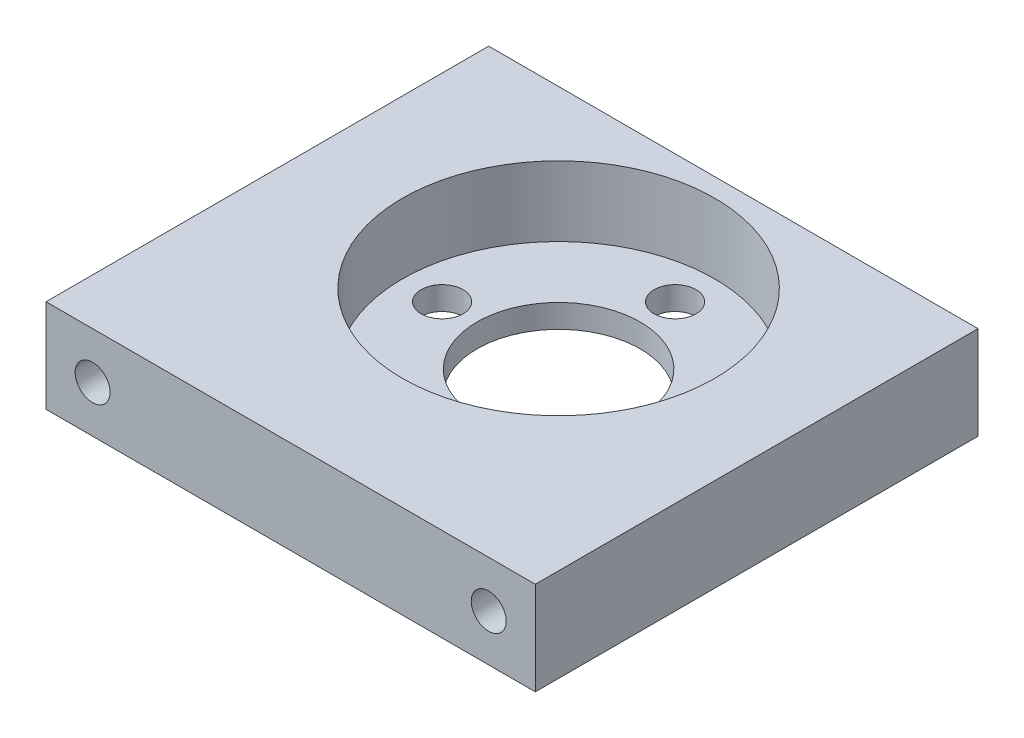
ISO-10303-21;
HEADER;
FILE_DESCRIPTION(('STEP AP214'),'2;1');
FILE_NAME('part.step','',(''),(''),'','','');
FILE_SCHEMA(('AUTOMOTIVE_DESIGN { 1 0 10303 214 1 1 1 1 }'));
ENDSEC;
DATA;
#1=APPLICATION_CONTEXT('core data for automotive mechanical design processes');
#2=APPLICATION_PROTOCOL_DEFINITION('international standard','automotive_design',2000,#1);
#3=PRODUCT_CONTEXT('',#1,'mechanical');
#4=PRODUCT('Part','Part','',(#3));
#5=PRODUCT_RELATED_PRODUCT_CATEGORY('part','',(#4));
#6=PRODUCT_DEFINITION_FORMATION('','',#4);
#7=PRODUCT_DEFINITION_CONTEXT('part definition',#1,'design');
#8=PRODUCT_DEFINITION('design','',#6,#7);
#9=PRODUCT_DEFINITION_SHAPE('','',#8);
#10=(LENGTH_UNIT() NAMED_UNIT(*) SI_UNIT(.MILLI.,.METRE.));
#11=(NAMED_UNIT(*) PLANE_ANGLE_UNIT() SI_UNIT($,.RADIAN.));
#12=(NAMED_UNIT(*) SI_UNIT($,.STERADIAN.) SOLID_ANGLE_UNIT());
#13=UNCERTAINTY_MEASURE_WITH_UNIT(LENGTH_MEASURE(1.E-05),#10,'distance_accuracy_value','');
#14=(GEOMETRIC_REPRESENTATION_CONTEXT(3) GLOBAL_UNCERTAINTY_ASSIGNED_CONTEXT((#13)) GLOBAL_UNIT_ASSIGNED_CONTEXT((#10,
#11,#12)) REPRESENTATION_CONTEXT('',''));
#15=CARTESIAN_POINT('',(0.,0.,0.));
#16=DIRECTION('',(0.,0.,1.));
#17=DIRECTION('',(1.,0.,0.));
#18=AXIS2_PLACEMENT_3D('',#15,#16,#17);
#19=CARTESIAN_POINT('',(0.,8.,0.));
#20=DIRECTION('',(1.,0.,0.));
#21=DIRECTION('',(0.,0.,-1.));
#22=AXIS2_PLACEMENT_3D('',#19,#20,#21);
#23=PLANE('',#22);
#24=DIRECTION('',(0.,0.,1.));
#25=VECTOR('',#24,1.);
#26=CARTESIAN_POINT('',(0.,8.,0.));
#27=LINE('',#26,#25);
#28=CARTESIAN_POINT('',(0.,8.,-38.));
#29=VERTEX_POINT('',#28);
#30=CARTESIAN_POINT('',(0.,8.,0.));
#31=VERTEX_POINT('',#30);
#32=EDGE_CURVE('E94',#29,#31,#27,.T.);
#33=ORIENTED_EDGE('',*,*,#32,.F.);
#34=DIRECTION('',(0.,1.,0.));
#35=VECTOR('',#34,1.);
#36=CARTESIAN_POINT('',(0.,-0.000999999999999265,-38.));
#37=LINE('',#36,#35);
#38=CARTESIAN_POINT('',(0.,0.,-38.));
#39=VERTEX_POINT('',#38);
#40=EDGE_CURVE('E150',#39,#29,#37,.T.);
#41=ORIENTED_EDGE('',*,*,#40,.F.);
#42=DIRECTION('',(0.,0.,1.));
#43=VECTOR('',#42,1.);
#44=CARTESIAN_POINT('',(0.,0.,0.));
#45=LINE('',#44,#43);
#46=CARTESIAN_POINT('',(0.,0.,0.));
#47=VERTEX_POINT('',#46);
#48=EDGE_CURVE('E85',#39,#47,#45,.T.);
#49=ORIENTED_EDGE('',*,*,#48,.T.);
#50=DIRECTION('',(0.,-1.,0.));
#51=VECTOR('',#50,1.);
#52=CARTESIAN_POINT('',(0.,8.,0.));
#53=LINE('',#52,#51);
#54=EDGE_CURVE('E11',#31,#47,#53,.T.);
#55=ORIENTED_EDGE('',*,*,#54,.F.);
#56=EDGE_LOOP('',(#33,#41,#49,#55));
#57=FACE_BOUND('',#56,.T.);
#58=ADVANCED_FACE('F41',(#57),#23,.F.);
#59=CARTESIAN_POINT('',(0.,8.,0.));
#60=DIRECTION('',(0.,0.,-1.));
#61=DIRECTION('',(-1.,0.,0.));
#62=AXIS2_PLACEMENT_3D('',#59,#60,#61);
#63=PLANE('',#62);
#64=CARTESIAN_POINT('',(38.,4.,0.));
#65=DIRECTION('',(0.,0.,-1.));
#66=DIRECTION('',(-1.,0.,0.));
#67=AXIS2_PLACEMENT_3D('',#64,#65,#66);
#68=CIRCLE('',#67,1.5);
#69=CARTESIAN_POINT('',(36.5,4.,0.));
#70=VERTEX_POINT('',#69);
#71=EDGE_CURVE('E130',#70,#70,#68,.T.);
#72=ORIENTED_EDGE('',*,*,#71,.T.);
#73=EDGE_LOOP('',(#72));
#74=FACE_BOUND('',#73,.T.);
#75=CARTESIAN_POINT('',(4.,4.,0.));
#76=DIRECTION('',(0.,0.,-1.));
#77=DIRECTION('',(-1.,0.,0.));
#78=AXIS2_PLACEMENT_3D('',#75,#76,#77);
#79=CIRCLE('',#78,1.5);
#80=CARTESIAN_POINT('',(2.5,4.,0.));
#81=VERTEX_POINT('',#80);
#82=EDGE_CURVE('E138',#81,#81,#79,.T.);
#83=ORIENTED_EDGE('',*,*,#82,.T.);
#84=EDGE_LOOP('',(#83));
#85=FACE_BOUND('',#84,.T.);
#86=DIRECTION('',(1.,0.,0.));
#87=VECTOR('',#86,1.);
#88=CARTESIAN_POINT('',(0.,0.,0.));
#89=LINE('',#88,#87);
#90=CARTESIAN_POINT('',(42.,0.,0.));
#91=VERTEX_POINT('',#90);
#92=EDGE_CURVE('E76',#47,#91,#89,.T.);
#93=ORIENTED_EDGE('',*,*,#92,.T.);
#94=DIRECTION('',(0.,-1.,0.));
#95=VECTOR('',#94,1.);
#96=CARTESIAN_POINT('',(42.,8.,0.));
#97=LINE('',#96,#95);
#98=CARTESIAN_POINT('',(42.,8.,0.));
#99=VERTEX_POINT('',#98);
#100=EDGE_CURVE('E48',#99,#91,#97,.T.);
#101=ORIENTED_EDGE('',*,*,#100,.F.);
#102=DIRECTION('',(1.,0.,0.));
#103=VECTOR('',#102,1.);
#104=CARTESIAN_POINT('',(0.,8.,0.));
#105=LINE('',#104,#103);
#106=EDGE_CURVE('E64',#31,#99,#105,.T.);
#107=ORIENTED_EDGE('',*,*,#106,.F.);
#108=ORIENTED_EDGE('',*,*,#54,.T.);
#109=EDGE_LOOP('',(#93,#101,#107,#108));
#110=FACE_BOUND('',#109,.T.);
#111=ADVANCED_FACE('F78',(#74,#85,#110),#63,.F.);
#112=CARTESIAN_POINT('',(42.,8.,0.));
#113=DIRECTION('',(-1.,0.,0.));
#114=DIRECTION('',(0.,0.,1.));
#115=AXIS2_PLACEMENT_3D('',#112,#113,#114);
#116=PLANE('',#115);
#117=DIRECTION('',(0.,0.,-1.));
#118=VECTOR('',#117,1.);
#119=CARTESIAN_POINT('',(42.,0.,0.));
#120=LINE('',#119,#118);
#121=CARTESIAN_POINT('',(42.,0.,-38.));
#122=VERTEX_POINT('',#121);
#123=EDGE_CURVE('E84',#91,#122,#120,.T.);
#124=ORIENTED_EDGE('',*,*,#123,.T.);
#125=DIRECTION('',(0.,1.,0.));
#126=VECTOR('',#125,1.);
#127=CARTESIAN_POINT('',(42.,-0.000999999999999265,-38.));
#128=LINE('',#127,#126);
#129=CARTESIAN_POINT('',(42.,8.,-38.));
#130=VERTEX_POINT('',#129);
#131=EDGE_CURVE('E55',#122,#130,#128,.T.);
#132=ORIENTED_EDGE('',*,*,#131,.T.);
#133=DIRECTION('',(0.,0.,-1.));
#134=VECTOR('',#133,1.);
#135=CARTESIAN_POINT('',(42.,8.,0.));
#136=LINE('',#135,#134);
#137=EDGE_CURVE('E90',#99,#130,#136,.T.);
#138=ORIENTED_EDGE('',*,*,#137,.F.);
#139=ORIENTED_EDGE('',*,*,#100,.T.);
#140=EDGE_LOOP('',(#124,#132,#138,#139));
#141=FACE_BOUND('',#140,.T.);
#142=ADVANCED_FACE('F89',(#141),#116,.F.);
#143=CARTESIAN_POINT('',(0.,8.,0.));
#144=DIRECTION('',(0.,-1.,0.));
#145=DIRECTION('',(0.,0.,-1.));
#146=AXIS2_PLACEMENT_3D('',#143,#144,#145);
#147=PLANE('',#146);
#148=CARTESIAN_POINT('',(21.,8.,-23.));
#149=DIRECTION('',(0.,1.,0.));
#150=DIRECTION('',(0.,0.,1.));
#151=AXIS2_PLACEMENT_3D('',#148,#149,#150);
#152=CIRCLE('',#151,13.4);
#153=CARTESIAN_POINT('',(21.,8.,-9.60000000000003));
#154=VERTEX_POINT('',#153);
#155=EDGE_CURVE('E102',#154,#154,#152,.T.);
#156=ORIENTED_EDGE('',*,*,#155,.F.);
#157=EDGE_LOOP('',(#156));
#158=FACE_BOUND('',#157,.T.);
#159=ORIENTED_EDGE('',*,*,#137,.T.);
#160=DIRECTION('',(1.,0.,0.));
#161=VECTOR('',#160,1.);
#162=CARTESIAN_POINT('',(0.,8.,-38.));
#163=LINE('',#162,#161);
#164=EDGE_CURVE('E153',#29,#130,#163,.T.);
#165=ORIENTED_EDGE('',*,*,#164,.F.);
#166=ORIENTED_EDGE('',*,*,#32,.T.);
#167=ORIENTED_EDGE('',*,*,#106,.T.);
#168=EDGE_LOOP('',(#159,#165,#166,#167));
#169=FACE_BOUND('',#168,.T.);
#170=ADVANCED_FACE('F160',(#158,#169),#147,.F.);
#171=CARTESIAN_POINT('',(0.,0.,0.));
#172=DIRECTION('',(0.,-1.,0.));
#173=DIRECTION('',(0.,0.,-1.));
#174=AXIS2_PLACEMENT_3D('',#171,#172,#173);
#175=PLANE('',#174);
#176=DIRECTION('',(1.,0.,0.));
#177=VECTOR('',#176,1.);
#178=CARTESIAN_POINT('',(0.,0.,-38.));
#179=LINE('',#178,#177);
#180=EDGE_CURVE('E93',#39,#122,#179,.T.);
#181=ORIENTED_EDGE('',*,*,#180,.T.);
#182=ORIENTED_EDGE('',*,*,#123,.F.);
#183=ORIENTED_EDGE('',*,*,#92,.F.);
#184=ORIENTED_EDGE('',*,*,#48,.F.);
#185=EDGE_LOOP('',(#181,#182,#183,#184));
#186=FACE_BOUND('',#185,.T.);
#187=CARTESIAN_POINT('',(21.,0.,-33.));
#188=DIRECTION('',(0.,1.,0.));
#189=DIRECTION('',(0.,0.,1.));
#190=AXIS2_PLACEMENT_3D('',#187,#188,#189);
#191=CIRCLE('',#190,1.79999999999999);
#192=CARTESIAN_POINT('',(21.,0.,-31.2));
#193=VERTEX_POINT('',#192);
#194=EDGE_CURVE('E111',#193,#193,#191,.T.);
#195=ORIENTED_EDGE('',*,*,#194,.T.);
#196=EDGE_LOOP('',(#195));
#197=FACE_BOUND('',#196,.T.);
#198=CARTESIAN_POINT('',(31.,0.,-23.));
#199=DIRECTION('',(0.,1.,0.));
#200=DIRECTION('',(0.,0.,1.));
#201=AXIS2_PLACEMENT_3D('',#198,#199,#200);
#202=CIRCLE('',#201,1.79999999999999);
#203=CARTESIAN_POINT('',(31.,0.,-21.2));
#204=VERTEX_POINT('',#203);
#205=EDGE_CURVE('E117',#204,#204,#202,.T.);
#206=ORIENTED_EDGE('',*,*,#205,.T.);
#207=EDGE_LOOP('',(#206));
#208=FACE_BOUND('',#207,.T.);
#209=CARTESIAN_POINT('',(21.,0.,-13.));
#210=DIRECTION('',(0.,1.,0.));
#211=DIRECTION('',(0.,0.,1.));
#212=AXIS2_PLACEMENT_3D('',#209,#210,#211);
#213=CIRCLE('',#212,1.79999999999998);
#214=CARTESIAN_POINT('',(21.,0.,-11.2));
#215=VERTEX_POINT('',#214);
#216=EDGE_CURVE('E118',#215,#215,#213,.T.);
#217=ORIENTED_EDGE('',*,*,#216,.T.);
#218=EDGE_LOOP('',(#217));
#219=FACE_BOUND('',#218,.T.);
#220=CARTESIAN_POINT('',(11.,0.,-23.));
#221=DIRECTION('',(0.,1.,0.));
#222=DIRECTION('',(0.,0.,1.));
#223=AXIS2_PLACEMENT_3D('',#220,#221,#222);
#224=CIRCLE('',#223,1.79999999999998);
#225=CARTESIAN_POINT('',(11.,0.,-21.2));
#226=VERTEX_POINT('',#225);
#227=EDGE_CURVE('E129',#226,#226,#224,.T.);
#228=ORIENTED_EDGE('',*,*,#227,.T.);
#229=EDGE_LOOP('',(#228));
#230=FACE_BOUND('',#229,.T.);
#231=CARTESIAN_POINT('',(21.,0.,-23.));
#232=DIRECTION('',(0.,1.,0.));
#233=DIRECTION('',(0.,0.,1.));
#234=AXIS2_PLACEMENT_3D('',#231,#232,#233);
#235=CIRCLE('',#234,7.);
#236=CARTESIAN_POINT('',(21.,0.,-16.));
#237=VERTEX_POINT('',#236);
#238=EDGE_CURVE('E105',#237,#237,#235,.T.);
#239=ORIENTED_EDGE('',*,*,#238,.T.);
#240=EDGE_LOOP('',(#239));
#241=FACE_BOUND('',#240,.T.);
#242=ADVANCED_FACE('F91',(#186,#197,#208,#219,#230,#241),#175,.T.);
#243=CARTESIAN_POINT('',(21.,2.,-23.));
#244=DIRECTION('',(0.,1.,0.));
#245=DIRECTION('',(0.,0.,1.));
#246=AXIS2_PLACEMENT_3D('',#243,#244,#245);
#247=CYLINDRICAL_SURFACE('',#246,13.4);
#248=CARTESIAN_POINT('',(21.,2.,-23.));
#249=DIRECTION('',(0.,1.,0.));
#250=DIRECTION('',(0.,0.,1.));
#251=AXIS2_PLACEMENT_3D('',#248,#249,#250);
#252=CIRCLE('',#251,13.4);
#253=CARTESIAN_POINT('',(21.,2.,-9.60000000000003));
#254=VERTEX_POINT('',#253);
#255=EDGE_CURVE('E99',#254,#254,#252,.T.);
#256=ORIENTED_EDGE('',*,*,#255,.F.);
#257=EDGE_LOOP('',(#256));
#258=FACE_BOUND('',#257,.T.);
#259=ORIENTED_EDGE('',*,*,#155,.T.);
#260=EDGE_LOOP('',(#259));
#261=FACE_BOUND('',#260,.T.);
#262=ADVANCED_FACE('F168',(#258,#261),#247,.F.);
#263=CARTESIAN_POINT('',(21.,2.,-23.));
#264=DIRECTION('',(0.,1.,0.));
#265=DIRECTION('',(0.,0.,1.));
#266=AXIS2_PLACEMENT_3D('',#263,#264,#265);
#267=PLANE('',#266);
#268=CARTESIAN_POINT('',(21.,2.,-23.));
#269=DIRECTION('',(0.,1.,0.));
#270=DIRECTION('',(0.,0.,1.));
#271=AXIS2_PLACEMENT_3D('',#268,#269,#270);
#272=CIRCLE('',#271,7.);
#273=CARTESIAN_POINT('',(21.,2.,-16.));
#274=VERTEX_POINT('',#273);
#275=EDGE_CURVE('E108',#274,#274,#272,.T.);
#276=ORIENTED_EDGE('',*,*,#275,.F.);
#277=EDGE_LOOP('',(#276));
#278=FACE_BOUND('',#277,.T.);
#279=CARTESIAN_POINT('',(21.,2.,-33.));
#280=DIRECTION('',(0.,1.,0.));
#281=DIRECTION('',(0.,0.,1.));
#282=AXIS2_PLACEMENT_3D('',#279,#280,#281);
#283=CIRCLE('',#282,1.79999999999999);
#284=CARTESIAN_POINT('',(21.,2.,-31.2));
#285=VERTEX_POINT('',#284);
#286=EDGE_CURVE('E121',#285,#285,#283,.T.);
#287=ORIENTED_EDGE('',*,*,#286,.F.);
#288=EDGE_LOOP('',(#287));
#289=FACE_BOUND('',#288,.T.);
#290=CARTESIAN_POINT('',(31.,2.,-23.));
#291=DIRECTION('',(0.,1.,0.));
#292=DIRECTION('',(0.,0.,1.));
#293=AXIS2_PLACEMENT_3D('',#290,#291,#292);
#294=CIRCLE('',#293,1.79999999999999);
#295=CARTESIAN_POINT('',(31.,2.,-21.2));
#296=VERTEX_POINT('',#295);
#297=EDGE_CURVE('E114',#296,#296,#294,.T.);
#298=ORIENTED_EDGE('',*,*,#297,.F.);
#299=EDGE_LOOP('',(#298));
#300=FACE_BOUND('',#299,.T.);
#301=CARTESIAN_POINT('',(21.,2.,-13.));
#302=DIRECTION('',(0.,1.,0.));
#303=DIRECTION('',(0.,0.,1.));
#304=AXIS2_PLACEMENT_3D('',#301,#302,#303);
#305=CIRCLE('',#304,1.79999999999998);
#306=CARTESIAN_POINT('',(21.,2.,-11.2));
#307=VERTEX_POINT('',#306);
#308=EDGE_CURVE('E133',#307,#307,#305,.T.);
#309=ORIENTED_EDGE('',*,*,#308,.F.);
#310=EDGE_LOOP('',(#309));
#311=FACE_BOUND('',#310,.T.);
#312=CARTESIAN_POINT('',(11.,2.,-23.));
#313=DIRECTION('',(0.,1.,0.));
#314=DIRECTION('',(0.,0.,1.));
#315=AXIS2_PLACEMENT_3D('',#312,#313,#314);
#316=CIRCLE('',#315,1.79999999999998);
#317=CARTESIAN_POINT('',(11.,2.,-21.2));
#318=VERTEX_POINT('',#317);
#319=EDGE_CURVE('E126',#318,#318,#316,.T.);
#320=ORIENTED_EDGE('',*,*,#319,.F.);
#321=EDGE_LOOP('',(#320));
#322=FACE_BOUND('',#321,.T.);
#323=ORIENTED_EDGE('',*,*,#255,.T.);
#324=EDGE_LOOP('',(#323));
#325=FACE_BOUND('',#324,.T.);
#326=ADVANCED_FACE('F214',(#278,#289,#300,#311,#322,#325),#267,.T.);
#327=CARTESIAN_POINT('',(11.,0.,-23.));
#328=DIRECTION('',(0.,1.,0.));
#329=DIRECTION('',(0.,0.,1.));
#330=AXIS2_PLACEMENT_3D('',#327,#328,#329);
#331=CYLINDRICAL_SURFACE('',#330,1.79999999999998);
#332=ORIENTED_EDGE('',*,*,#227,.F.);
#333=EDGE_LOOP('',(#332));
#334=FACE_BOUND('',#333,.T.);
#335=ORIENTED_EDGE('',*,*,#319,.T.);
#336=EDGE_LOOP('',(#335));
#337=FACE_BOUND('',#336,.T.);
#338=ADVANCED_FACE('F210',(#334,#337),#331,.F.);
#339=CARTESIAN_POINT('',(21.,0.,-13.));
#340=DIRECTION('',(0.,1.,0.));
#341=DIRECTION('',(0.,0.,1.));
#342=AXIS2_PLACEMENT_3D('',#339,#340,#341);
#343=CYLINDRICAL_SURFACE('',#342,1.79999999999998);
#344=ORIENTED_EDGE('',*,*,#216,.F.);
#345=EDGE_LOOP('',(#344));
#346=FACE_BOUND('',#345,.T.);
#347=ORIENTED_EDGE('',*,*,#308,.T.);
#348=EDGE_LOOP('',(#347));
#349=FACE_BOUND('',#348,.T.);
#350=ADVANCED_FACE('F206',(#346,#349),#343,.F.);
#351=CARTESIAN_POINT('',(31.,0.,-23.));
#352=DIRECTION('',(0.,1.,0.));
#353=DIRECTION('',(0.,0.,1.));
#354=AXIS2_PLACEMENT_3D('',#351,#352,#353);
#355=CYLINDRICAL_SURFACE('',#354,1.79999999999999);
#356=ORIENTED_EDGE('',*,*,#205,.F.);
#357=EDGE_LOOP('',(#356));
#358=FACE_BOUND('',#357,.T.);
#359=ORIENTED_EDGE('',*,*,#297,.T.);
#360=EDGE_LOOP('',(#359));
#361=FACE_BOUND('',#360,.T.);
#362=ADVANCED_FACE('F209',(#358,#361),#355,.F.);
#363=CARTESIAN_POINT('',(21.,0.,-33.));
#364=DIRECTION('',(0.,1.,0.));
#365=DIRECTION('',(0.,0.,1.));
#366=AXIS2_PLACEMENT_3D('',#363,#364,#365);
#367=CYLINDRICAL_SURFACE('',#366,1.79999999999999);
#368=ORIENTED_EDGE('',*,*,#194,.F.);
#369=EDGE_LOOP('',(#368));
#370=FACE_BOUND('',#369,.T.);
#371=ORIENTED_EDGE('',*,*,#286,.T.);
#372=EDGE_LOOP('',(#371));
#373=FACE_BOUND('',#372,.T.);
#374=ADVANCED_FACE('F200',(#370,#373),#367,.F.);
#375=CARTESIAN_POINT('',(21.,0.,-23.));
#376=DIRECTION('',(0.,1.,0.));
#377=DIRECTION('',(0.,0.,1.));
#378=AXIS2_PLACEMENT_3D('',#375,#376,#377);
#379=CYLINDRICAL_SURFACE('',#378,7.);
#380=ORIENTED_EDGE('',*,*,#238,.F.);
#381=EDGE_LOOP('',(#380));
#382=FACE_BOUND('',#381,.T.);
#383=ORIENTED_EDGE('',*,*,#275,.T.);
#384=EDGE_LOOP('',(#383));
#385=FACE_BOUND('',#384,.T.);
#386=ADVANCED_FACE('F192',(#382,#385),#379,.F.);
#387=CARTESIAN_POINT('',(4.,4.,0.));
#388=DIRECTION('',(0.,0.,-1.));
#389=DIRECTION('',(-1.,0.,0.));
#390=AXIS2_PLACEMENT_3D('',#387,#388,#389);
#391=CYLINDRICAL_SURFACE('',#390,1.5);
#392=CARTESIAN_POINT('',(4.,4.,-38.));
#393=DIRECTION('',(0.,0.,1.));
#394=DIRECTION('',(1.,0.,0.));
#395=AXIS2_PLACEMENT_3D('',#392,#393,#394);
#396=CIRCLE('',#395,1.5);
#397=CARTESIAN_POINT('',(5.5,4.,-38.));
#398=VERTEX_POINT('',#397);
#399=EDGE_CURVE('E144',#398,#398,#396,.T.);
#400=ORIENTED_EDGE('',*,*,#399,.F.);
#401=EDGE_LOOP('',(#400));
#402=FACE_BOUND('',#401,.T.);
#403=ORIENTED_EDGE('',*,*,#82,.F.);
#404=EDGE_LOOP('',(#403));
#405=FACE_BOUND('',#404,.T.);
#406=ADVANCED_FACE('F189',(#402,#405),#391,.F.);
#407=CARTESIAN_POINT('',(38.,4.,0.));
#408=DIRECTION('',(0.,0.,-1.));
#409=DIRECTION('',(-1.,0.,0.));
#410=AXIS2_PLACEMENT_3D('',#407,#408,#409);
#411=CYLINDRICAL_SURFACE('',#410,1.5);
#412=CARTESIAN_POINT('',(38.,4.,-38.));
#413=DIRECTION('',(0.,0.,1.));
#414=DIRECTION('',(1.,0.,0.));
#415=AXIS2_PLACEMENT_3D('',#412,#413,#414);
#416=CIRCLE('',#415,1.5);
#417=CARTESIAN_POINT('',(39.5,4.,-38.));
#418=VERTEX_POINT('',#417);
#419=EDGE_CURVE('E147',#418,#418,#416,.T.);
#420=ORIENTED_EDGE('',*,*,#419,.F.);
#421=EDGE_LOOP('',(#420));
#422=FACE_BOUND('',#421,.T.);
#423=ORIENTED_EDGE('',*,*,#71,.F.);
#424=EDGE_LOOP('',(#423));
#425=FACE_BOUND('',#424,.T.);
#426=ADVANCED_FACE('F191',(#422,#425),#411,.F.);
#427=CARTESIAN_POINT('',(0.,-0.000999999999999265,-38.));
#428=DIRECTION('',(0.,0.,1.));
#429=DIRECTION('',(1.,0.,0.));
#430=AXIS2_PLACEMENT_3D('',#427,#428,#429);
#431=PLANE('',#430);
#432=ORIENTED_EDGE('',*,*,#399,.T.);
#433=EDGE_LOOP('',(#432));
#434=FACE_BOUND('',#433,.T.);
#435=ORIENTED_EDGE('',*,*,#419,.T.);
#436=EDGE_LOOP('',(#435));
#437=FACE_BOUND('',#436,.T.);
#438=ORIENTED_EDGE('',*,*,#40,.T.);
#439=ORIENTED_EDGE('',*,*,#164,.T.);
#440=ORIENTED_EDGE('',*,*,#131,.F.);
#441=ORIENTED_EDGE('',*,*,#180,.F.);
#442=EDGE_LOOP('',(#438,#439,#440,#441));
#443=FACE_BOUND('',#442,.T.);
#444=ADVANCED_FACE('F156',(#434,#437,#443),#431,.F.);
#445=CLOSED_SHELL('',(#58,#111,#142,#170,#242,#262,#326,#338,#350,#362,#374,#386,#406,#426,#444));
#446=MANIFOLD_SOLID_BREP('B2',#445);
#447=ADVANCED_BREP_SHAPE_REPRESENTATION('',(#18,#446),#14);
#448=SHAPE_DEFINITION_REPRESENTATION(#9,#447);
ENDSEC;
END-ISO-10303-21;
